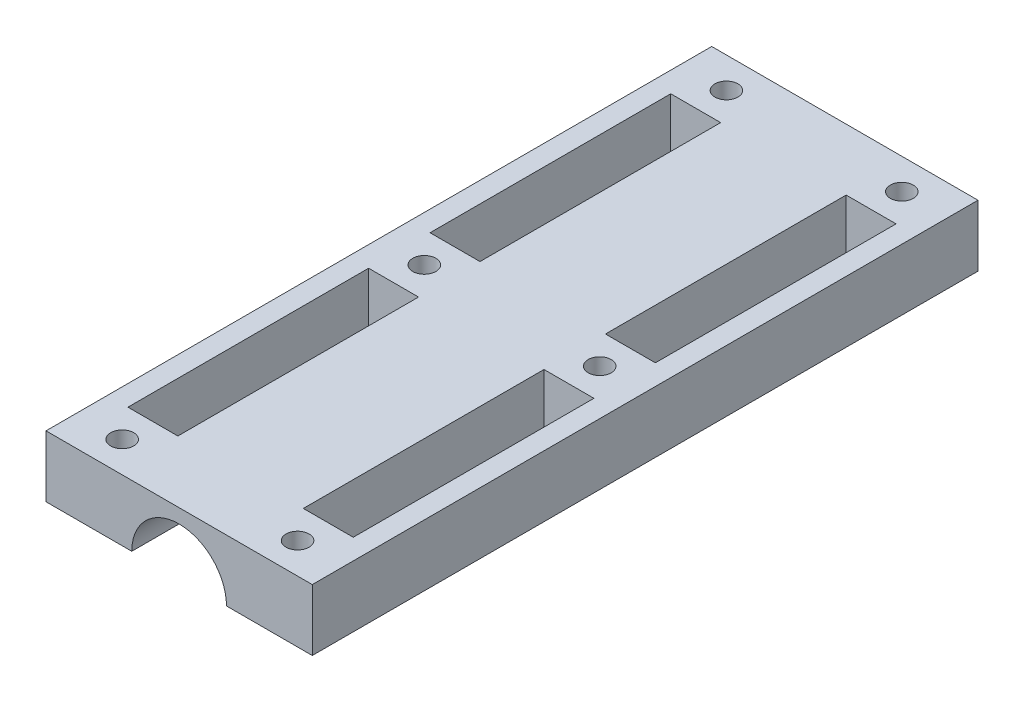
ISO-10303-21;
HEADER;
FILE_DESCRIPTION(('STEP AP214'),'2;1');
FILE_NAME('part.step','',(''),(''),'','','');
FILE_SCHEMA(('AUTOMOTIVE_DESIGN { 1 0 10303 214 1 1 1 1 }'));
ENDSEC;
DATA;
#1=APPLICATION_CONTEXT('core data for automotive mechanical design processes');
#2=APPLICATION_PROTOCOL_DEFINITION('international standard','automotive_design',2000,#1);
#3=PRODUCT_CONTEXT('',#1,'mechanical');
#4=PRODUCT('Part','Part','',(#3));
#5=PRODUCT_RELATED_PRODUCT_CATEGORY('part','',(#4));
#6=PRODUCT_DEFINITION_FORMATION('','',#4);
#7=PRODUCT_DEFINITION_CONTEXT('part definition',#1,'design');
#8=PRODUCT_DEFINITION('design','',#6,#7);
#9=PRODUCT_DEFINITION_SHAPE('','',#8);
#10=(LENGTH_UNIT() NAMED_UNIT(*) SI_UNIT(.MILLI.,.METRE.));
#11=(NAMED_UNIT(*) PLANE_ANGLE_UNIT() SI_UNIT($,.RADIAN.));
#12=(NAMED_UNIT(*) SI_UNIT($,.STERADIAN.) SOLID_ANGLE_UNIT());
#13=UNCERTAINTY_MEASURE_WITH_UNIT(LENGTH_MEASURE(1.E-05),#10,'distance_accuracy_value','');
#14=(GEOMETRIC_REPRESENTATION_CONTEXT(3) GLOBAL_UNCERTAINTY_ASSIGNED_CONTEXT((#13)) GLOBAL_UNIT_ASSIGNED_CONTEXT((#10,
#11,#12)) REPRESENTATION_CONTEXT('',''));
#15=CARTESIAN_POINT('',(0.,0.,0.));
#16=DIRECTION('',(0.,0.,1.));
#17=DIRECTION('',(1.,0.,0.));
#18=AXIS2_PLACEMENT_3D('',#15,#16,#17);
#19=CARTESIAN_POINT('',(9.25,-12.,-130.));
#20=DIRECTION('',(0.,1.,0.));
#21=DIRECTION('',(-1.,0.,0.));
#22=AXIS2_PLACEMENT_3D('',#19,#20,#21);
#23=PLANE('',#22);
#24=DIRECTION('',(-1.,0.,0.));
#25=VECTOR('',#24,1.);
#26=CARTESIAN_POINT('',(22.,-12.,-59.));
#27=LINE('',#26,#25);
#28=CARTESIAN_POINT('',(22.,-12.,-59.));
#29=VERTEX_POINT('',#28);
#30=CARTESIAN_POINT('',(12.25,-12.,-59.));
#31=VERTEX_POINT('',#30);
#32=EDGE_CURVE('E199',#29,#31,#27,.T.);
#33=ORIENTED_EDGE('',*,*,#32,.T.);
#34=DIRECTION('',(0.,0.,1.));
#35=VECTOR('',#34,1.);
#36=CARTESIAN_POINT('',(12.25,-12.,-12.));
#37=LINE('',#36,#35);
#38=CARTESIAN_POINT('',(12.25,-12.,-12.));
#39=VERTEX_POINT('',#38);
#40=EDGE_CURVE('E193',#31,#39,#37,.T.);
#41=ORIENTED_EDGE('',*,*,#40,.T.);
#42=DIRECTION('',(1.,0.,0.));
#43=VECTOR('',#42,1.);
#44=CARTESIAN_POINT('',(22.,-12.,-12.));
#45=LINE('',#44,#43);
#46=CARTESIAN_POINT('',(22.,-12.,-12.));
#47=VERTEX_POINT('',#46);
#48=EDGE_CURVE('E200',#39,#47,#45,.T.);
#49=ORIENTED_EDGE('',*,*,#48,.T.);
#50=DIRECTION('',(0.,0.,-1.));
#51=VECTOR('',#50,1.);
#52=CARTESIAN_POINT('',(22.,-12.,-12.));
#53=LINE('',#52,#51);
#54=EDGE_CURVE('E188',#47,#29,#53,.T.);
#55=ORIENTED_EDGE('',*,*,#54,.T.);
#56=EDGE_LOOP('',(#33,#41,#49,#55));
#57=FACE_BOUND('',#56,.T.);
#58=CARTESIAN_POINT('',(17.125,-12.,-6.));
#59=DIRECTION('',(0.,1.,0.));
#60=DIRECTION('',(0.,0.,-1.));
#61=AXIS2_PLACEMENT_3D('',#58,#59,#60);
#62=CIRCLE('',#61,2.25);
#63=CARTESIAN_POINT('',(17.125,-12.,-8.25));
#64=VERTEX_POINT('',#63);
#65=EDGE_CURVE('E215',#64,#64,#62,.T.);
#66=ORIENTED_EDGE('',*,*,#65,.T.);
#67=EDGE_LOOP('',(#66));
#68=FACE_BOUND('',#67,.T.);
#69=CARTESIAN_POINT('',(17.125,-12.,-124.));
#70=DIRECTION('',(0.,1.,0.));
#71=DIRECTION('',(0.,0.,-1.));
#72=AXIS2_PLACEMENT_3D('',#69,#70,#71);
#73=CIRCLE('',#72,2.25);
#74=CARTESIAN_POINT('',(17.125,-12.,-126.25));
#75=VERTEX_POINT('',#74);
#76=EDGE_CURVE('E228',#75,#75,#73,.T.);
#77=ORIENTED_EDGE('',*,*,#76,.T.);
#78=EDGE_LOOP('',(#77));
#79=FACE_BOUND('',#78,.T.);
#80=CARTESIAN_POINT('',(17.125,-12.,-65.));
#81=DIRECTION('',(0.,1.,0.));
#82=DIRECTION('',(0.,0.,-1.));
#83=AXIS2_PLACEMENT_3D('',#80,#81,#82);
#84=CIRCLE('',#83,2.25);
#85=CARTESIAN_POINT('',(17.125,-12.,-67.25));
#86=VERTEX_POINT('',#85);
#87=EDGE_CURVE('E234',#86,#86,#84,.T.);
#88=ORIENTED_EDGE('',*,*,#87,.T.);
#89=EDGE_LOOP('',(#88));
#90=FACE_BOUND('',#89,.T.);
#91=DIRECTION('',(1.,0.,0.));
#92=VECTOR('',#91,1.);
#93=CARTESIAN_POINT('',(9.25,-12.,0.));
#94=LINE('',#93,#92);
#95=CARTESIAN_POINT('',(9.25,-12.,0.));
#96=VERTEX_POINT('',#95);
#97=CARTESIAN_POINT('',(26.,-12.,0.));
#98=VERTEX_POINT('',#97);
#99=EDGE_CURVE('E379',#96,#98,#94,.T.);
#100=ORIENTED_EDGE('',*,*,#99,.F.);
#101=DIRECTION('',(0.,0.,1.));
#102=VECTOR('',#101,1.);
#103=CARTESIAN_POINT('',(9.25,-12.,-130.));
#104=LINE('',#103,#102);
#105=CARTESIAN_POINT('',(9.25,-12.,-130.));
#106=VERTEX_POINT('',#105);
#107=EDGE_CURVE('E394',#106,#96,#104,.T.);
#108=ORIENTED_EDGE('',*,*,#107,.F.);
#109=DIRECTION('',(1.,0.,0.));
#110=VECTOR('',#109,1.);
#111=CARTESIAN_POINT('',(9.25,-12.,-130.));
#112=LINE('',#111,#110);
#113=CARTESIAN_POINT('',(26.,-12.,-130.));
#114=VERTEX_POINT('',#113);
#115=EDGE_CURVE('E363',#106,#114,#112,.T.);
#116=ORIENTED_EDGE('',*,*,#115,.T.);
#117=DIRECTION('',(0.,0.,1.));
#118=VECTOR('',#117,1.);
#119=CARTESIAN_POINT('',(26.,-12.,-130.));
#120=LINE('',#119,#118);
#121=EDGE_CURVE('E391',#114,#98,#120,.T.);
#122=ORIENTED_EDGE('',*,*,#121,.T.);
#123=EDGE_LOOP('',(#100,#108,#116,#122));
#124=FACE_BOUND('',#123,.T.);
#125=DIRECTION('',(0.,0.,-1.));
#126=VECTOR('',#125,1.);
#127=CARTESIAN_POINT('',(22.,-12.,-71.));
#128=LINE('',#127,#126);
#129=CARTESIAN_POINT('',(22.,-12.,-71.));
#130=VERTEX_POINT('',#129);
#131=CARTESIAN_POINT('',(22.,-12.,-118.));
#132=VERTEX_POINT('',#131);
#133=EDGE_CURVE('E240',#130,#132,#128,.T.);
#134=ORIENTED_EDGE('',*,*,#133,.T.);
#135=DIRECTION('',(-1.,0.,0.));
#136=VECTOR('',#135,1.);
#137=CARTESIAN_POINT('',(22.,-12.,-118.));
#138=LINE('',#137,#136);
#139=CARTESIAN_POINT('',(12.25,-12.,-118.));
#140=VERTEX_POINT('',#139);
#141=EDGE_CURVE('E250',#132,#140,#138,.T.);
#142=ORIENTED_EDGE('',*,*,#141,.T.);
#143=DIRECTION('',(0.,0.,1.));
#144=VECTOR('',#143,1.);
#145=CARTESIAN_POINT('',(12.25,-12.,-71.));
#146=LINE('',#145,#144);
#147=CARTESIAN_POINT('',(12.25,-12.,-71.));
#148=VERTEX_POINT('',#147);
#149=EDGE_CURVE('E247',#140,#148,#146,.T.);
#150=ORIENTED_EDGE('',*,*,#149,.T.);
#151=DIRECTION('',(1.,0.,0.));
#152=VECTOR('',#151,1.);
#153=CARTESIAN_POINT('',(22.,-12.,-71.));
#154=LINE('',#153,#152);
#155=EDGE_CURVE('E243',#148,#130,#154,.T.);
#156=ORIENTED_EDGE('',*,*,#155,.T.);
#157=EDGE_LOOP('',(#134,#142,#150,#156));
#158=FACE_BOUND('',#157,.T.);
#159=ADVANCED_FACE('F37',(#57,#68,#79,#90,#124,#158),#23,.F.);
#160=CARTESIAN_POINT('',(-26.,0.,-130.));
#161=DIRECTION('',(0.,-1.,0.));
#162=DIRECTION('',(1.,0.,0.));
#163=AXIS2_PLACEMENT_3D('',#160,#161,#162);
#164=PLANE('',#163);
#165=DIRECTION('',(-1.,0.,0.));
#166=VECTOR('',#165,1.);
#167=CARTESIAN_POINT('',(22.,0.,-59.));
#168=LINE('',#167,#166);
#169=CARTESIAN_POINT('',(22.,0.,-59.));
#170=VERTEX_POINT('',#169);
#171=CARTESIAN_POINT('',(12.25,0.,-59.));
#172=VERTEX_POINT('',#171);
#173=EDGE_CURVE('E213',#170,#172,#168,.T.);
#174=ORIENTED_EDGE('',*,*,#173,.F.);
#175=DIRECTION('',(0.,0.,-1.));
#176=VECTOR('',#175,1.);
#177=CARTESIAN_POINT('',(22.,0.,-12.));
#178=LINE('',#177,#176);
#179=CARTESIAN_POINT('',(22.,0.,-12.));
#180=VERTEX_POINT('',#179);
#181=EDGE_CURVE('E191',#180,#170,#178,.T.);
#182=ORIENTED_EDGE('',*,*,#181,.F.);
#183=DIRECTION('',(1.,0.,0.));
#184=VECTOR('',#183,1.);
#185=CARTESIAN_POINT('',(22.,0.,-12.));
#186=LINE('',#185,#184);
#187=CARTESIAN_POINT('',(12.25,0.,-12.));
#188=VERTEX_POINT('',#187);
#189=EDGE_CURVE('E208',#188,#180,#186,.T.);
#190=ORIENTED_EDGE('',*,*,#189,.F.);
#191=DIRECTION('',(0.,0.,1.));
#192=VECTOR('',#191,1.);
#193=CARTESIAN_POINT('',(12.25,0.,-12.));
#194=LINE('',#193,#192);
#195=EDGE_CURVE('E205',#172,#188,#194,.T.);
#196=ORIENTED_EDGE('',*,*,#195,.F.);
#197=EDGE_LOOP('',(#174,#182,#190,#196));
#198=FACE_BOUND('',#197,.T.);
#199=CARTESIAN_POINT('',(17.125,0.,-6.));
#200=DIRECTION('',(0.,1.,0.));
#201=DIRECTION('',(0.,0.,-1.));
#202=AXIS2_PLACEMENT_3D('',#199,#200,#201);
#203=CIRCLE('',#202,2.25);
#204=CARTESIAN_POINT('',(17.125,0.,-8.25));
#205=VERTEX_POINT('',#204);
#206=EDGE_CURVE('E225',#205,#205,#203,.T.);
#207=ORIENTED_EDGE('',*,*,#206,.F.);
#208=EDGE_LOOP('',(#207));
#209=FACE_BOUND('',#208,.T.);
#210=CARTESIAN_POINT('',(17.125,0.,-124.));
#211=DIRECTION('',(0.,1.,0.));
#212=DIRECTION('',(0.,0.,-1.));
#213=AXIS2_PLACEMENT_3D('',#210,#211,#212);
#214=CIRCLE('',#213,2.25);
#215=CARTESIAN_POINT('',(17.125,0.,-126.25));
#216=VERTEX_POINT('',#215);
#217=EDGE_CURVE('E231',#216,#216,#214,.T.);
#218=ORIENTED_EDGE('',*,*,#217,.F.);
#219=EDGE_LOOP('',(#218));
#220=FACE_BOUND('',#219,.T.);
#221=CARTESIAN_POINT('',(17.125,0.,-65.));
#222=DIRECTION('',(0.,1.,0.));
#223=DIRECTION('',(0.,0.,-1.));
#224=AXIS2_PLACEMENT_3D('',#221,#222,#223);
#225=CIRCLE('',#224,2.25);
#226=CARTESIAN_POINT('',(17.125,0.,-67.25));
#227=VERTEX_POINT('',#226);
#228=EDGE_CURVE('E237',#227,#227,#225,.T.);
#229=ORIENTED_EDGE('',*,*,#228,.F.);
#230=EDGE_LOOP('',(#229));
#231=FACE_BOUND('',#230,.T.);
#232=DIRECTION('',(-1.,0.,0.));
#233=VECTOR('',#232,1.);
#234=CARTESIAN_POINT('',(-26.,0.,0.));
#235=LINE('',#234,#233);
#236=CARTESIAN_POINT('',(26.,0.,0.));
#237=VERTEX_POINT('',#236);
#238=CARTESIAN_POINT('',(-26.,0.,0.));
#239=VERTEX_POINT('',#238);
#240=EDGE_CURVE('E358',#237,#239,#235,.T.);
#241=ORIENTED_EDGE('',*,*,#240,.F.);
#242=DIRECTION('',(0.,0.,1.));
#243=VECTOR('',#242,1.);
#244=CARTESIAN_POINT('',(26.,0.,-130.));
#245=LINE('',#244,#243);
#246=CARTESIAN_POINT('',(26.,0.,-130.));
#247=VERTEX_POINT('',#246);
#248=EDGE_CURVE('E388',#247,#237,#245,.T.);
#249=ORIENTED_EDGE('',*,*,#248,.F.);
#250=DIRECTION('',(-1.,0.,0.));
#251=VECTOR('',#250,1.);
#252=CARTESIAN_POINT('',(-26.,0.,-130.));
#253=LINE('',#252,#251);
#254=CARTESIAN_POINT('',(-26.,0.,-130.));
#255=VERTEX_POINT('',#254);
#256=EDGE_CURVE('E368',#247,#255,#253,.T.);
#257=ORIENTED_EDGE('',*,*,#256,.T.);
#258=DIRECTION('',(0.,0.,1.));
#259=VECTOR('',#258,1.);
#260=CARTESIAN_POINT('',(-26.,0.,-130.));
#261=LINE('',#260,#259);
#262=EDGE_CURVE('E371',#255,#239,#261,.T.);
#263=ORIENTED_EDGE('',*,*,#262,.T.);
#264=EDGE_LOOP('',(#241,#249,#257,#263));
#265=FACE_BOUND('',#264,.T.);
#266=DIRECTION('',(1.,0.,0.));
#267=VECTOR('',#266,1.);
#268=CARTESIAN_POINT('',(-22.,0.,-118.));
#269=LINE('',#268,#267);
#270=CARTESIAN_POINT('',(-22.,0.,-118.));
#271=VERTEX_POINT('',#270);
#272=CARTESIAN_POINT('',(-12.25,0.,-118.));
#273=VERTEX_POINT('',#272);
#274=EDGE_CURVE('E338',#271,#273,#269,.T.);
#275=ORIENTED_EDGE('',*,*,#274,.T.);
#276=DIRECTION('',(0.,0.,1.));
#277=VECTOR('',#276,1.);
#278=CARTESIAN_POINT('',(-12.25,0.,-71.));
#279=LINE('',#278,#277);
#280=CARTESIAN_POINT('',(-12.25,0.,-71.));
#281=VERTEX_POINT('',#280);
#282=EDGE_CURVE('E341',#273,#281,#279,.T.);
#283=ORIENTED_EDGE('',*,*,#282,.T.);
#284=DIRECTION('',(-1.,0.,0.));
#285=VECTOR('',#284,1.);
#286=CARTESIAN_POINT('',(-22.,0.,-71.));
#287=LINE('',#286,#285);
#288=CARTESIAN_POINT('',(-22.,0.,-71.));
#289=VERTEX_POINT('',#288);
#290=EDGE_CURVE('E326',#281,#289,#287,.T.);
#291=ORIENTED_EDGE('',*,*,#290,.T.);
#292=DIRECTION('',(0.,0.,-1.));
#293=VECTOR('',#292,1.);
#294=CARTESIAN_POINT('',(-22.,0.,-71.));
#295=LINE('',#294,#293);
#296=EDGE_CURVE('E300',#289,#271,#295,.T.);
#297=ORIENTED_EDGE('',*,*,#296,.T.);
#298=EDGE_LOOP('',(#275,#283,#291,#297));
#299=FACE_BOUND('',#298,.T.);
#300=CARTESIAN_POINT('',(-17.125,0.,-65.));
#301=DIRECTION('',(0.,-1.,0.));
#302=DIRECTION('',(0.,0.,-1.));
#303=AXIS2_PLACEMENT_3D('',#300,#301,#302);
#304=CIRCLE('',#303,2.25);
#305=CARTESIAN_POINT('',(-17.125,0.,-67.25));
#306=VERTEX_POINT('',#305);
#307=EDGE_CURVE('E266',#306,#306,#304,.T.);
#308=ORIENTED_EDGE('',*,*,#307,.T.);
#309=EDGE_LOOP('',(#308));
#310=FACE_BOUND('',#309,.T.);
#311=CARTESIAN_POINT('',(-17.125,0.,-124.));
#312=DIRECTION('',(0.,-1.,0.));
#313=DIRECTION('',(0.,0.,-1.));
#314=AXIS2_PLACEMENT_3D('',#311,#312,#313);
#315=CIRCLE('',#314,2.25);
#316=CARTESIAN_POINT('',(-17.125,0.,-126.25));
#317=VERTEX_POINT('',#316);
#318=EDGE_CURVE('E314',#317,#317,#315,.T.);
#319=ORIENTED_EDGE('',*,*,#318,.T.);
#320=EDGE_LOOP('',(#319));
#321=FACE_BOUND('',#320,.T.);
#322=CARTESIAN_POINT('',(-17.125,0.,-6.));
#323=DIRECTION('',(0.,-1.,0.));
#324=DIRECTION('',(0.,0.,-1.));
#325=AXIS2_PLACEMENT_3D('',#322,#323,#324);
#326=CIRCLE('',#325,2.25);
#327=CARTESIAN_POINT('',(-17.125,0.,-8.25));
#328=VERTEX_POINT('',#327);
#329=EDGE_CURVE('E308',#328,#328,#326,.T.);
#330=ORIENTED_EDGE('',*,*,#329,.T.);
#331=EDGE_LOOP('',(#330));
#332=FACE_BOUND('',#331,.T.);
#333=DIRECTION('',(0.,0.,1.));
#334=VECTOR('',#333,1.);
#335=CARTESIAN_POINT('',(-12.25,0.,-12.));
#336=LINE('',#335,#334);
#337=CARTESIAN_POINT('',(-12.25,0.,-59.));
#338=VERTEX_POINT('',#337);
#339=CARTESIAN_POINT('',(-12.25,0.,-12.));
#340=VERTEX_POINT('',#339);
#341=EDGE_CURVE('E289',#338,#340,#336,.T.);
#342=ORIENTED_EDGE('',*,*,#341,.T.);
#343=DIRECTION('',(-1.,0.,0.));
#344=VECTOR('',#343,1.);
#345=CARTESIAN_POINT('',(-22.,0.,-12.));
#346=LINE('',#345,#344);
#347=CARTESIAN_POINT('',(-22.,0.,-12.));
#348=VERTEX_POINT('',#347);
#349=EDGE_CURVE('E293',#340,#348,#346,.T.);
#350=ORIENTED_EDGE('',*,*,#349,.T.);
#351=DIRECTION('',(0.,0.,-1.));
#352=VECTOR('',#351,1.);
#353=CARTESIAN_POINT('',(-22.,0.,-12.));
#354=LINE('',#353,#352);
#355=CARTESIAN_POINT('',(-22.,0.,-59.));
#356=VERTEX_POINT('',#355);
#357=EDGE_CURVE('E276',#348,#356,#354,.T.);
#358=ORIENTED_EDGE('',*,*,#357,.T.);
#359=DIRECTION('',(1.,0.,0.));
#360=VECTOR('',#359,1.);
#361=CARTESIAN_POINT('',(-22.,0.,-59.));
#362=LINE('',#361,#360);
#363=EDGE_CURVE('E286',#356,#338,#362,.T.);
#364=ORIENTED_EDGE('',*,*,#363,.T.);
#365=EDGE_LOOP('',(#342,#350,#358,#364));
#366=FACE_BOUND('',#365,.T.);
#367=DIRECTION('',(0.,0.,-1.));
#368=VECTOR('',#367,1.);
#369=CARTESIAN_POINT('',(22.,0.,-71.));
#370=LINE('',#369,#368);
#371=CARTESIAN_POINT('',(22.,0.,-71.));
#372=VERTEX_POINT('',#371);
#373=CARTESIAN_POINT('',(22.,0.,-118.));
#374=VERTEX_POINT('',#373);
#375=EDGE_CURVE('E219',#372,#374,#370,.T.);
#376=ORIENTED_EDGE('',*,*,#375,.F.);
#377=DIRECTION('',(1.,0.,0.));
#378=VECTOR('',#377,1.);
#379=CARTESIAN_POINT('',(22.,0.,-71.));
#380=LINE('',#379,#378);
#381=CARTESIAN_POINT('',(12.25,0.,-71.));
#382=VERTEX_POINT('',#381);
#383=EDGE_CURVE('E256',#382,#372,#380,.T.);
#384=ORIENTED_EDGE('',*,*,#383,.F.);
#385=DIRECTION('',(0.,0.,1.));
#386=VECTOR('',#385,1.);
#387=CARTESIAN_POINT('',(12.25,0.,-71.));
#388=LINE('',#387,#386);
#389=CARTESIAN_POINT('',(12.25,0.,-118.));
#390=VERTEX_POINT('',#389);
#391=EDGE_CURVE('E259',#390,#382,#388,.T.);
#392=ORIENTED_EDGE('',*,*,#391,.F.);
#393=DIRECTION('',(-1.,0.,0.));
#394=VECTOR('',#393,1.);
#395=CARTESIAN_POINT('',(22.,0.,-118.));
#396=LINE('',#395,#394);
#397=EDGE_CURVE('E244',#374,#390,#396,.T.);
#398=ORIENTED_EDGE('',*,*,#397,.F.);
#399=EDGE_LOOP('',(#376,#384,#392,#398));
#400=FACE_BOUND('',#399,.T.);
#401=ADVANCED_FACE('F408',(#198,#209,#220,#231,#265,#299,#310,#321,#332,#366,#400),#164,.F.);
#402=CARTESIAN_POINT('',(-26.,0.,-130.));
#403=DIRECTION('',(1.,0.,0.));
#404=DIRECTION('',(0.,0.,1.));
#405=AXIS2_PLACEMENT_3D('',#402,#403,#404);
#406=PLANE('',#405);
#407=DIRECTION('',(0.,-1.,0.));
#408=VECTOR('',#407,1.);
#409=CARTESIAN_POINT('',(-26.,0.,0.));
#410=LINE('',#409,#408);
#411=CARTESIAN_POINT('',(-26.,-12.,0.));
#412=VERTEX_POINT('',#411);
#413=EDGE_CURVE('E348',#239,#412,#410,.T.);
#414=ORIENTED_EDGE('',*,*,#413,.F.);
#415=ORIENTED_EDGE('',*,*,#262,.F.);
#416=DIRECTION('',(0.,-1.,0.));
#417=VECTOR('',#416,1.);
#418=CARTESIAN_POINT('',(-26.,0.,-130.));
#419=LINE('',#418,#417);
#420=CARTESIAN_POINT('',(-26.,-12.,-130.));
#421=VERTEX_POINT('',#420);
#422=EDGE_CURVE('E354',#255,#421,#419,.T.);
#423=ORIENTED_EDGE('',*,*,#422,.T.);
#424=DIRECTION('',(0.,0.,1.));
#425=VECTOR('',#424,1.);
#426=CARTESIAN_POINT('',(-26.,-12.,-130.));
#427=LINE('',#426,#425);
#428=EDGE_CURVE('E11',#421,#412,#427,.T.);
#429=ORIENTED_EDGE('',*,*,#428,.T.);
#430=EDGE_LOOP('',(#414,#415,#423,#429));
#431=FACE_BOUND('',#430,.T.);
#432=ADVANCED_FACE('F39',(#431),#406,.F.);
#433=CARTESIAN_POINT('',(-26.,-12.,-130.));
#434=DIRECTION('',(0.,1.,0.));
#435=DIRECTION('',(0.,0.,-1.));
#436=AXIS2_PLACEMENT_3D('',#433,#434,#435);
#437=PLANE('',#436);
#438=DIRECTION('',(0.,0.,-1.));
#439=VECTOR('',#438,1.);
#440=CARTESIAN_POINT('',(-22.,-12.,-12.));
#441=LINE('',#440,#439);
#442=CARTESIAN_POINT('',(-22.,-12.,-12.));
#443=VERTEX_POINT('',#442);
#444=CARTESIAN_POINT('',(-22.,-12.,-59.));
#445=VERTEX_POINT('',#444);
#446=EDGE_CURVE('E282',#443,#445,#441,.T.);
#447=ORIENTED_EDGE('',*,*,#446,.F.);
#448=DIRECTION('',(-1.,0.,0.));
#449=VECTOR('',#448,1.);
#450=CARTESIAN_POINT('',(-22.,-12.,-12.));
#451=LINE('',#450,#449);
#452=CARTESIAN_POINT('',(-12.25,-12.,-12.));
#453=VERTEX_POINT('',#452);
#454=EDGE_CURVE('E279',#453,#443,#451,.T.);
#455=ORIENTED_EDGE('',*,*,#454,.F.);
#456=DIRECTION('',(0.,0.,1.));
#457=VECTOR('',#456,1.);
#458=CARTESIAN_POINT('',(-12.25,-12.,-12.));
#459=LINE('',#458,#457);
#460=CARTESIAN_POINT('',(-12.25,-12.,-59.));
#461=VERTEX_POINT('',#460);
#462=EDGE_CURVE('E275',#461,#453,#459,.T.);
#463=ORIENTED_EDGE('',*,*,#462,.F.);
#464=DIRECTION('',(1.,0.,0.));
#465=VECTOR('',#464,1.);
#466=CARTESIAN_POINT('',(-22.,-12.,-59.));
#467=LINE('',#466,#465);
#468=EDGE_CURVE('E272',#445,#461,#467,.T.);
#469=ORIENTED_EDGE('',*,*,#468,.F.);
#470=EDGE_LOOP('',(#447,#455,#463,#469));
#471=FACE_BOUND('',#470,.T.);
#472=CARTESIAN_POINT('',(-17.125,-12.,-6.));
#473=DIRECTION('',(0.,-1.,0.));
#474=DIRECTION('',(0.,0.,-1.));
#475=AXIS2_PLACEMENT_3D('',#472,#473,#474);
#476=CIRCLE('',#475,2.25);
#477=CARTESIAN_POINT('',(-17.125,-12.,-8.25));
#478=VERTEX_POINT('',#477);
#479=EDGE_CURVE('E290',#478,#478,#476,.T.);
#480=ORIENTED_EDGE('',*,*,#479,.F.);
#481=EDGE_LOOP('',(#480));
#482=FACE_BOUND('',#481,.T.);
#483=CARTESIAN_POINT('',(-17.125,-12.,-124.));
#484=DIRECTION('',(0.,-1.,0.));
#485=DIRECTION('',(0.,0.,-1.));
#486=AXIS2_PLACEMENT_3D('',#483,#484,#485);
#487=CIRCLE('',#486,2.25);
#488=CARTESIAN_POINT('',(-17.125,-12.,-126.25));
#489=VERTEX_POINT('',#488);
#490=EDGE_CURVE('E311',#489,#489,#487,.T.);
#491=ORIENTED_EDGE('',*,*,#490,.F.);
#492=EDGE_LOOP('',(#491));
#493=FACE_BOUND('',#492,.T.);
#494=CARTESIAN_POINT('',(-17.125,-12.,-65.));
#495=DIRECTION('',(0.,-1.,0.));
#496=DIRECTION('',(0.,0.,-1.));
#497=AXIS2_PLACEMENT_3D('',#494,#495,#496);
#498=CIRCLE('',#497,2.25);
#499=CARTESIAN_POINT('',(-17.125,-12.,-67.25));
#500=VERTEX_POINT('',#499);
#501=EDGE_CURVE('E317',#500,#500,#498,.T.);
#502=ORIENTED_EDGE('',*,*,#501,.F.);
#503=EDGE_LOOP('',(#502));
#504=FACE_BOUND('',#503,.T.);
#505=DIRECTION('',(-1.,0.,0.));
#506=VECTOR('',#505,1.);
#507=CARTESIAN_POINT('',(-22.,-12.,-71.));
#508=LINE('',#507,#506);
#509=CARTESIAN_POINT('',(-12.25,-12.,-71.));
#510=VERTEX_POINT('',#509);
#511=CARTESIAN_POINT('',(-22.,-12.,-71.));
#512=VERTEX_POINT('',#511);
#513=EDGE_CURVE('E332',#510,#512,#508,.T.);
#514=ORIENTED_EDGE('',*,*,#513,.F.);
#515=DIRECTION('',(0.,0.,1.));
#516=VECTOR('',#515,1.);
#517=CARTESIAN_POINT('',(-12.25,-12.,-71.));
#518=LINE('',#517,#516);
#519=CARTESIAN_POINT('',(-12.25,-12.,-118.));
#520=VERTEX_POINT('',#519);
#521=EDGE_CURVE('E329',#520,#510,#518,.T.);
#522=ORIENTED_EDGE('',*,*,#521,.F.);
#523=DIRECTION('',(1.,0.,0.));
#524=VECTOR('',#523,1.);
#525=CARTESIAN_POINT('',(-22.,-12.,-118.));
#526=LINE('',#525,#524);
#527=CARTESIAN_POINT('',(-22.,-12.,-118.));
#528=VERTEX_POINT('',#527);
#529=EDGE_CURVE('E325',#528,#520,#526,.T.);
#530=ORIENTED_EDGE('',*,*,#529,.F.);
#531=DIRECTION('',(0.,0.,-1.));
#532=VECTOR('',#531,1.);
#533=CARTESIAN_POINT('',(-22.,-12.,-71.));
#534=LINE('',#533,#532);
#535=EDGE_CURVE('E322',#512,#528,#534,.T.);
#536=ORIENTED_EDGE('',*,*,#535,.F.);
#537=EDGE_LOOP('',(#514,#522,#530,#536));
#538=FACE_BOUND('',#537,.T.);
#539=DIRECTION('',(1.,0.,0.));
#540=VECTOR('',#539,1.);
#541=CARTESIAN_POINT('',(-26.,-12.,0.));
#542=LINE('',#541,#540);
#543=CARTESIAN_POINT('',(-9.25,-12.,0.));
#544=VERTEX_POINT('',#543);
#545=EDGE_CURVE('E374',#412,#544,#542,.T.);
#546=ORIENTED_EDGE('',*,*,#545,.F.);
#547=ORIENTED_EDGE('',*,*,#428,.F.);
#548=DIRECTION('',(1.,0.,0.));
#549=VECTOR('',#548,1.);
#550=CARTESIAN_POINT('',(-26.,-12.,-130.));
#551=LINE('',#550,#549);
#552=CARTESIAN_POINT('',(-9.25,-12.,-130.));
#553=VERTEX_POINT('',#552);
#554=EDGE_CURVE('E357',#421,#553,#551,.T.);
#555=ORIENTED_EDGE('',*,*,#554,.T.);
#556=DIRECTION('',(0.,0.,1.));
#557=VECTOR('',#556,1.);
#558=CARTESIAN_POINT('',(-9.25,-12.,-130.));
#559=LINE('',#558,#557);
#560=EDGE_CURVE('E45',#553,#544,#559,.T.);
#561=ORIENTED_EDGE('',*,*,#560,.T.);
#562=EDGE_LOOP('',(#546,#547,#555,#561));
#563=FACE_BOUND('',#562,.T.);
#564=ADVANCED_FACE('F399',(#471,#482,#493,#504,#538,#563),#437,.F.);
#565=CARTESIAN_POINT('',(0.,-12.,-130.));
#566=DIRECTION('',(0.,0.,1.));
#567=DIRECTION('',(-1.,0.,0.));
#568=AXIS2_PLACEMENT_3D('',#565,#566,#567);
#569=CYLINDRICAL_SURFACE('',#568,9.25);
#570=CARTESIAN_POINT('',(0.,-12.,0.));
#571=DIRECTION('',(0.,0.,-1.));
#572=DIRECTION('',(1.,0.,0.));
#573=AXIS2_PLACEMENT_3D('',#570,#571,#572);
#574=CIRCLE('',#573,9.25);
#575=EDGE_CURVE('E377',#544,#96,#574,.T.);
#576=ORIENTED_EDGE('',*,*,#575,.F.);
#577=ORIENTED_EDGE('',*,*,#560,.F.);
#578=CARTESIAN_POINT('',(0.,-12.,-130.));
#579=DIRECTION('',(0.,0.,-1.));
#580=DIRECTION('',(1.,0.,0.));
#581=AXIS2_PLACEMENT_3D('',#578,#579,#580);
#582=CIRCLE('',#581,9.25);
#583=EDGE_CURVE('E361',#553,#106,#582,.T.);
#584=ORIENTED_EDGE('',*,*,#583,.T.);
#585=ORIENTED_EDGE('',*,*,#107,.T.);
#586=EDGE_LOOP('',(#576,#577,#584,#585));
#587=FACE_BOUND('',#586,.T.);
#588=ADVANCED_FACE('F417',(#587),#569,.F.);
#589=CARTESIAN_POINT('',(26.,0.,-130.));
#590=DIRECTION('',(-1.,0.,0.));
#591=DIRECTION('',(0.,-1.,0.));
#592=AXIS2_PLACEMENT_3D('',#589,#590,#591);
#593=PLANE('',#592);
#594=DIRECTION('',(0.,1.,0.));
#595=VECTOR('',#594,1.);
#596=CARTESIAN_POINT('',(26.,0.,0.));
#597=LINE('',#596,#595);
#598=EDGE_CURVE('E382',#98,#237,#597,.T.);
#599=ORIENTED_EDGE('',*,*,#598,.F.);
#600=ORIENTED_EDGE('',*,*,#121,.F.);
#601=DIRECTION('',(0.,1.,0.));
#602=VECTOR('',#601,1.);
#603=CARTESIAN_POINT('',(26.,0.,-130.));
#604=LINE('',#603,#602);
#605=EDGE_CURVE('E366',#114,#247,#604,.T.);
#606=ORIENTED_EDGE('',*,*,#605,.T.);
#607=ORIENTED_EDGE('',*,*,#248,.T.);
#608=EDGE_LOOP('',(#599,#600,#606,#607));
#609=FACE_BOUND('',#608,.T.);
#610=ADVANCED_FACE('F422',(#609),#593,.F.);
#611=CARTESIAN_POINT('',(0.,-12.,-130.));
#612=DIRECTION('',(0.,0.,-1.));
#613=DIRECTION('',(1.,0.,0.));
#614=AXIS2_PLACEMENT_3D('',#611,#612,#613);
#615=PLANE('',#614);
#616=ORIENTED_EDGE('',*,*,#422,.F.);
#617=ORIENTED_EDGE('',*,*,#256,.F.);
#618=ORIENTED_EDGE('',*,*,#605,.F.);
#619=ORIENTED_EDGE('',*,*,#115,.F.);
#620=ORIENTED_EDGE('',*,*,#583,.F.);
#621=ORIENTED_EDGE('',*,*,#554,.F.);
#622=EDGE_LOOP('',(#616,#617,#618,#619,#620,#621));
#623=FACE_BOUND('',#622,.T.);
#624=ADVANCED_FACE('F413',(#623),#615,.T.);
#625=CARTESIAN_POINT('',(0.,-12.,0.));
#626=DIRECTION('',(0.,0.,-1.));
#627=DIRECTION('',(1.,0.,0.));
#628=AXIS2_PLACEMENT_3D('',#625,#626,#627);
#629=PLANE('',#628);
#630=ORIENTED_EDGE('',*,*,#413,.T.);
#631=ORIENTED_EDGE('',*,*,#545,.T.);
#632=ORIENTED_EDGE('',*,*,#575,.T.);
#633=ORIENTED_EDGE('',*,*,#99,.T.);
#634=ORIENTED_EDGE('',*,*,#598,.T.);
#635=ORIENTED_EDGE('',*,*,#240,.T.);
#636=EDGE_LOOP('',(#630,#631,#632,#633,#634,#635));
#637=FACE_BOUND('',#636,.T.);
#638=ADVANCED_FACE('F403',(#637),#629,.F.);
#639=CARTESIAN_POINT('',(-22.,-12.,-71.));
#640=DIRECTION('',(-1.,0.,0.));
#641=DIRECTION('',(0.,0.,-1.));
#642=AXIS2_PLACEMENT_3D('',#639,#640,#641);
#643=PLANE('',#642);
#644=ORIENTED_EDGE('',*,*,#296,.F.);
#645=DIRECTION('',(0.,1.,0.));
#646=VECTOR('',#645,1.);
#647=CARTESIAN_POINT('',(-22.,-12.,-71.));
#648=LINE('',#647,#646);
#649=EDGE_CURVE('E346',#512,#289,#648,.T.);
#650=ORIENTED_EDGE('',*,*,#649,.F.);
#651=ORIENTED_EDGE('',*,*,#535,.T.);
#652=DIRECTION('',(0.,1.,0.));
#653=VECTOR('',#652,1.);
#654=CARTESIAN_POINT('',(-22.,-12.,-118.));
#655=LINE('',#654,#653);
#656=EDGE_CURVE('E335',#528,#271,#655,.T.);
#657=ORIENTED_EDGE('',*,*,#656,.T.);
#658=EDGE_LOOP('',(#644,#650,#651,#657));
#659=FACE_BOUND('',#658,.T.);
#660=ADVANCED_FACE('F468',(#659),#643,.F.);
#661=CARTESIAN_POINT('',(-22.,-12.,-71.));
#662=DIRECTION('',(0.,0.,1.));
#663=DIRECTION('',(-1.,0.,0.));
#664=AXIS2_PLACEMENT_3D('',#661,#662,#663);
#665=PLANE('',#664);
#666=ORIENTED_EDGE('',*,*,#290,.F.);
#667=DIRECTION('',(0.,1.,0.));
#668=VECTOR('',#667,1.);
#669=CARTESIAN_POINT('',(-12.25,-12.,-71.));
#670=LINE('',#669,#668);
#671=EDGE_CURVE('E349',#510,#281,#670,.T.);
#672=ORIENTED_EDGE('',*,*,#671,.F.);
#673=ORIENTED_EDGE('',*,*,#513,.T.);
#674=ORIENTED_EDGE('',*,*,#649,.T.);
#675=EDGE_LOOP('',(#666,#672,#673,#674));
#676=FACE_BOUND('',#675,.T.);
#677=ADVANCED_FACE('F459',(#676),#665,.F.);
#678=CARTESIAN_POINT('',(-12.25,-12.,-71.));
#679=DIRECTION('',(1.,0.,0.));
#680=DIRECTION('',(0.,0.,1.));
#681=AXIS2_PLACEMENT_3D('',#678,#679,#680);
#682=PLANE('',#681);
#683=ORIENTED_EDGE('',*,*,#282,.F.);
#684=DIRECTION('',(0.,1.,0.));
#685=VECTOR('',#684,1.);
#686=CARTESIAN_POINT('',(-12.25,-12.,-118.));
#687=LINE('',#686,#685);
#688=EDGE_CURVE('E351',#520,#273,#687,.T.);
#689=ORIENTED_EDGE('',*,*,#688,.F.);
#690=ORIENTED_EDGE('',*,*,#521,.T.);
#691=ORIENTED_EDGE('',*,*,#671,.T.);
#692=EDGE_LOOP('',(#683,#689,#690,#691));
#693=FACE_BOUND('',#692,.T.);
#694=ADVANCED_FACE('F463',(#693),#682,.F.);
#695=CARTESIAN_POINT('',(-22.,-12.,-118.));
#696=DIRECTION('',(0.,0.,-1.));
#697=DIRECTION('',(1.,0.,0.));
#698=AXIS2_PLACEMENT_3D('',#695,#696,#697);
#699=PLANE('',#698);
#700=ORIENTED_EDGE('',*,*,#274,.F.);
#701=ORIENTED_EDGE('',*,*,#656,.F.);
#702=ORIENTED_EDGE('',*,*,#529,.T.);
#703=ORIENTED_EDGE('',*,*,#688,.T.);
#704=EDGE_LOOP('',(#700,#701,#702,#703));
#705=FACE_BOUND('',#704,.T.);
#706=ADVANCED_FACE('F466',(#705),#699,.F.);
#707=CARTESIAN_POINT('',(-17.125,-12.,-65.));
#708=DIRECTION('',(0.,1.,0.));
#709=DIRECTION('',(0.,0.,-1.));
#710=AXIS2_PLACEMENT_3D('',#707,#708,#709);
#711=CYLINDRICAL_SURFACE('',#710,2.25);
#712=ORIENTED_EDGE('',*,*,#501,.T.);
#713=EDGE_LOOP('',(#712));
#714=FACE_BOUND('',#713,.T.);
#715=ORIENTED_EDGE('',*,*,#307,.F.);
#716=EDGE_LOOP('',(#715));
#717=FACE_BOUND('',#716,.T.);
#718=ADVANCED_FACE('F531',(#714,#717),#711,.F.);
#719=CARTESIAN_POINT('',(-17.125,-12.,-124.));
#720=DIRECTION('',(0.,1.,0.));
#721=DIRECTION('',(0.,0.,-1.));
#722=AXIS2_PLACEMENT_3D('',#719,#720,#721);
#723=CYLINDRICAL_SURFACE('',#722,2.25);
#724=ORIENTED_EDGE('',*,*,#490,.T.);
#725=EDGE_LOOP('',(#724));
#726=FACE_BOUND('',#725,.T.);
#727=ORIENTED_EDGE('',*,*,#318,.F.);
#728=EDGE_LOOP('',(#727));
#729=FACE_BOUND('',#728,.T.);
#730=ADVANCED_FACE('F527',(#726,#729),#723,.F.);
#731=CARTESIAN_POINT('',(-17.125,-12.,-6.));
#732=DIRECTION('',(0.,1.,0.));
#733=DIRECTION('',(0.,0.,-1.));
#734=AXIS2_PLACEMENT_3D('',#731,#732,#733);
#735=CYLINDRICAL_SURFACE('',#734,2.25);
#736=ORIENTED_EDGE('',*,*,#479,.T.);
#737=EDGE_LOOP('',(#736));
#738=FACE_BOUND('',#737,.T.);
#739=ORIENTED_EDGE('',*,*,#329,.F.);
#740=EDGE_LOOP('',(#739));
#741=FACE_BOUND('',#740,.T.);
#742=ADVANCED_FACE('F523',(#738,#741),#735,.F.);
#743=CARTESIAN_POINT('',(-22.,-12.,-59.));
#744=DIRECTION('',(0.,0.,-1.));
#745=DIRECTION('',(1.,0.,0.));
#746=AXIS2_PLACEMENT_3D('',#743,#744,#745);
#747=PLANE('',#746);
#748=ORIENTED_EDGE('',*,*,#363,.F.);
#749=DIRECTION('',(0.,1.,0.));
#750=VECTOR('',#749,1.);
#751=CARTESIAN_POINT('',(-22.,-12.,-59.));
#752=LINE('',#751,#750);
#753=EDGE_CURVE('E298',#445,#356,#752,.T.);
#754=ORIENTED_EDGE('',*,*,#753,.F.);
#755=ORIENTED_EDGE('',*,*,#468,.T.);
#756=DIRECTION('',(0.,1.,0.));
#757=VECTOR('',#756,1.);
#758=CARTESIAN_POINT('',(-12.25,-12.,-59.));
#759=LINE('',#758,#757);
#760=EDGE_CURVE('E285',#461,#338,#759,.T.);
#761=ORIENTED_EDGE('',*,*,#760,.T.);
#762=EDGE_LOOP('',(#748,#754,#755,#761));
#763=FACE_BOUND('',#762,.T.);
#764=ADVANCED_FACE('F513',(#763),#747,.F.);
#765=CARTESIAN_POINT('',(-22.,-12.,-12.));
#766=DIRECTION('',(-1.,0.,0.));
#767=DIRECTION('',(0.,0.,-1.));
#768=AXIS2_PLACEMENT_3D('',#765,#766,#767);
#769=PLANE('',#768);
#770=ORIENTED_EDGE('',*,*,#357,.F.);
#771=DIRECTION('',(0.,1.,0.));
#772=VECTOR('',#771,1.);
#773=CARTESIAN_POINT('',(-22.,-12.,-12.));
#774=LINE('',#773,#772);
#775=EDGE_CURVE('E301',#443,#348,#774,.T.);
#776=ORIENTED_EDGE('',*,*,#775,.F.);
#777=ORIENTED_EDGE('',*,*,#446,.T.);
#778=ORIENTED_EDGE('',*,*,#753,.T.);
#779=EDGE_LOOP('',(#770,#776,#777,#778));
#780=FACE_BOUND('',#779,.T.);
#781=ADVANCED_FACE('F509',(#780),#769,.F.);
#782=CARTESIAN_POINT('',(-22.,-12.,-12.));
#783=DIRECTION('',(0.,0.,1.));
#784=DIRECTION('',(-1.,0.,0.));
#785=AXIS2_PLACEMENT_3D('',#782,#783,#784);
#786=PLANE('',#785);
#787=ORIENTED_EDGE('',*,*,#349,.F.);
#788=DIRECTION('',(0.,1.,0.));
#789=VECTOR('',#788,1.);
#790=CARTESIAN_POINT('',(-12.25,-12.,-12.));
#791=LINE('',#790,#789);
#792=EDGE_CURVE('E303',#453,#340,#791,.T.);
#793=ORIENTED_EDGE('',*,*,#792,.F.);
#794=ORIENTED_EDGE('',*,*,#454,.T.);
#795=ORIENTED_EDGE('',*,*,#775,.T.);
#796=EDGE_LOOP('',(#787,#793,#794,#795));
#797=FACE_BOUND('',#796,.T.);
#798=ADVANCED_FACE('F512',(#797),#786,.F.);
#799=CARTESIAN_POINT('',(-12.25,-12.,-12.));
#800=DIRECTION('',(1.,0.,0.));
#801=DIRECTION('',(0.,0.,1.));
#802=AXIS2_PLACEMENT_3D('',#799,#800,#801);
#803=PLANE('',#802);
#804=ORIENTED_EDGE('',*,*,#341,.F.);
#805=ORIENTED_EDGE('',*,*,#760,.F.);
#806=ORIENTED_EDGE('',*,*,#462,.T.);
#807=ORIENTED_EDGE('',*,*,#792,.T.);
#808=EDGE_LOOP('',(#804,#805,#806,#807));
#809=FACE_BOUND('',#808,.T.);
#810=ADVANCED_FACE('F501',(#809),#803,.F.);
#811=CARTESIAN_POINT('',(22.,-12.,-71.));
#812=DIRECTION('',(-1.,0.,0.));
#813=DIRECTION('',(0.,0.,-1.));
#814=AXIS2_PLACEMENT_3D('',#811,#812,#813);
#815=PLANE('',#814);
#816=ORIENTED_EDGE('',*,*,#375,.T.);
#817=DIRECTION('',(0.,1.,0.));
#818=VECTOR('',#817,1.);
#819=CARTESIAN_POINT('',(22.,-12.,-118.));
#820=LINE('',#819,#818);
#821=EDGE_CURVE('E264',#132,#374,#820,.T.);
#822=ORIENTED_EDGE('',*,*,#821,.F.);
#823=ORIENTED_EDGE('',*,*,#133,.F.);
#824=DIRECTION('',(0.,1.,0.));
#825=VECTOR('',#824,1.);
#826=CARTESIAN_POINT('',(22.,-12.,-71.));
#827=LINE('',#826,#825);
#828=EDGE_CURVE('E253',#130,#372,#827,.T.);
#829=ORIENTED_EDGE('',*,*,#828,.T.);
#830=EDGE_LOOP('',(#816,#822,#823,#829));
#831=FACE_BOUND('',#830,.T.);
#832=ADVANCED_FACE('F483',(#831),#815,.T.);
#833=CARTESIAN_POINT('',(22.,-12.,-118.));
#834=DIRECTION('',(0.,0.,1.));
#835=DIRECTION('',(-1.,0.,0.));
#836=AXIS2_PLACEMENT_3D('',#833,#834,#835);
#837=PLANE('',#836);
#838=ORIENTED_EDGE('',*,*,#397,.T.);
#839=DIRECTION('',(0.,1.,0.));
#840=VECTOR('',#839,1.);
#841=CARTESIAN_POINT('',(12.25,-12.,-118.));
#842=LINE('',#841,#840);
#843=EDGE_CURVE('E267',#140,#390,#842,.T.);
#844=ORIENTED_EDGE('',*,*,#843,.F.);
#845=ORIENTED_EDGE('',*,*,#141,.F.);
#846=ORIENTED_EDGE('',*,*,#821,.T.);
#847=EDGE_LOOP('',(#838,#844,#845,#846));
#848=FACE_BOUND('',#847,.T.);
#849=ADVANCED_FACE('F493',(#848),#837,.T.);
#850=CARTESIAN_POINT('',(12.25,-12.,-71.));
#851=DIRECTION('',(1.,0.,0.));
#852=DIRECTION('',(0.,0.,1.));
#853=AXIS2_PLACEMENT_3D('',#850,#851,#852);
#854=PLANE('',#853);
#855=ORIENTED_EDGE('',*,*,#391,.T.);
#856=DIRECTION('',(0.,1.,0.));
#857=VECTOR('',#856,1.);
#858=CARTESIAN_POINT('',(12.25,-12.,-71.));
#859=LINE('',#858,#857);
#860=EDGE_CURVE('E269',#148,#382,#859,.T.);
#861=ORIENTED_EDGE('',*,*,#860,.F.);
#862=ORIENTED_EDGE('',*,*,#149,.F.);
#863=ORIENTED_EDGE('',*,*,#843,.T.);
#864=EDGE_LOOP('',(#855,#861,#862,#863));
#865=FACE_BOUND('',#864,.T.);
#866=ADVANCED_FACE('F491',(#865),#854,.T.);
#867=CARTESIAN_POINT('',(22.,-12.,-71.));
#868=DIRECTION('',(0.,0.,-1.));
#869=DIRECTION('',(1.,0.,0.));
#870=AXIS2_PLACEMENT_3D('',#867,#868,#869);
#871=PLANE('',#870);
#872=ORIENTED_EDGE('',*,*,#383,.T.);
#873=ORIENTED_EDGE('',*,*,#828,.F.);
#874=ORIENTED_EDGE('',*,*,#155,.F.);
#875=ORIENTED_EDGE('',*,*,#860,.T.);
#876=EDGE_LOOP('',(#872,#873,#874,#875));
#877=FACE_BOUND('',#876,.T.);
#878=ADVANCED_FACE('F488',(#877),#871,.T.);
#879=CARTESIAN_POINT('',(17.125,-12.,-65.));
#880=DIRECTION('',(0.,1.,0.));
#881=DIRECTION('',(0.,0.,-1.));
#882=AXIS2_PLACEMENT_3D('',#879,#880,#881);
#883=CYLINDRICAL_SURFACE('',#882,2.25);
#884=ORIENTED_EDGE('',*,*,#87,.F.);
#885=EDGE_LOOP('',(#884));
#886=FACE_BOUND('',#885,.T.);
#887=ORIENTED_EDGE('',*,*,#228,.T.);
#888=EDGE_LOOP('',(#887));
#889=FACE_BOUND('',#888,.T.);
#890=ADVANCED_FACE('F504',(#886,#889),#883,.F.);
#891=CARTESIAN_POINT('',(17.125,-12.,-124.));
#892=DIRECTION('',(0.,1.,0.));
#893=DIRECTION('',(0.,0.,-1.));
#894=AXIS2_PLACEMENT_3D('',#891,#892,#893);
#895=CYLINDRICAL_SURFACE('',#894,2.25);
#896=ORIENTED_EDGE('',*,*,#76,.F.);
#897=EDGE_LOOP('',(#896));
#898=FACE_BOUND('',#897,.T.);
#899=ORIENTED_EDGE('',*,*,#217,.T.);
#900=EDGE_LOOP('',(#899));
#901=FACE_BOUND('',#900,.T.);
#902=ADVANCED_FACE('F622',(#898,#901),#895,.F.);
#903=CARTESIAN_POINT('',(17.125,-12.,-6.));
#904=DIRECTION('',(0.,1.,0.));
#905=DIRECTION('',(0.,0.,-1.));
#906=AXIS2_PLACEMENT_3D('',#903,#904,#905);
#907=CYLINDRICAL_SURFACE('',#906,2.25);
#908=ORIENTED_EDGE('',*,*,#65,.F.);
#909=EDGE_LOOP('',(#908));
#910=FACE_BOUND('',#909,.T.);
#911=ORIENTED_EDGE('',*,*,#206,.T.);
#912=EDGE_LOOP('',(#911));
#913=FACE_BOUND('',#912,.T.);
#914=ADVANCED_FACE('F631',(#910,#913),#907,.F.);
#915=CARTESIAN_POINT('',(22.,-12.,-59.));
#916=DIRECTION('',(0.,0.,1.));
#917=DIRECTION('',(-1.,0.,0.));
#918=AXIS2_PLACEMENT_3D('',#915,#916,#917);
#919=PLANE('',#918);
#920=ORIENTED_EDGE('',*,*,#173,.T.);
#921=DIRECTION('',(0.,1.,0.));
#922=VECTOR('',#921,1.);
#923=CARTESIAN_POINT('',(12.25,-12.,-59.));
#924=LINE('',#923,#922);
#925=EDGE_CURVE('E203',#31,#172,#924,.T.);
#926=ORIENTED_EDGE('',*,*,#925,.F.);
#927=ORIENTED_EDGE('',*,*,#32,.F.);
#928=DIRECTION('',(0.,1.,0.));
#929=VECTOR('',#928,1.);
#930=CARTESIAN_POINT('',(22.,-12.,-59.));
#931=LINE('',#930,#929);
#932=EDGE_CURVE('E60',#29,#170,#931,.T.);
#933=ORIENTED_EDGE('',*,*,#932,.T.);
#934=EDGE_LOOP('',(#920,#926,#927,#933));
#935=FACE_BOUND('',#934,.T.);
#936=ADVANCED_FACE('F202',(#935),#919,.T.);
#937=CARTESIAN_POINT('',(12.25,-12.,-12.));
#938=DIRECTION('',(1.,0.,0.));
#939=DIRECTION('',(0.,0.,1.));
#940=AXIS2_PLACEMENT_3D('',#937,#938,#939);
#941=PLANE('',#940);
#942=ORIENTED_EDGE('',*,*,#195,.T.);
#943=DIRECTION('',(0.,1.,0.));
#944=VECTOR('',#943,1.);
#945=CARTESIAN_POINT('',(12.25,-12.,-12.));
#946=LINE('',#945,#944);
#947=EDGE_CURVE('E220',#39,#188,#946,.T.);
#948=ORIENTED_EDGE('',*,*,#947,.F.);
#949=ORIENTED_EDGE('',*,*,#40,.F.);
#950=ORIENTED_EDGE('',*,*,#925,.T.);
#951=EDGE_LOOP('',(#942,#948,#949,#950));
#952=FACE_BOUND('',#951,.T.);
#953=ADVANCED_FACE('F649',(#952),#941,.T.);
#954=CARTESIAN_POINT('',(22.,-12.,-12.));
#955=DIRECTION('',(0.,0.,-1.));
#956=DIRECTION('',(1.,0.,0.));
#957=AXIS2_PLACEMENT_3D('',#954,#955,#956);
#958=PLANE('',#957);
#959=ORIENTED_EDGE('',*,*,#189,.T.);
#960=DIRECTION('',(0.,1.,0.));
#961=VECTOR('',#960,1.);
#962=CARTESIAN_POINT('',(22.,-12.,-12.));
#963=LINE('',#962,#961);
#964=EDGE_CURVE('E52',#47,#180,#963,.T.);
#965=ORIENTED_EDGE('',*,*,#964,.F.);
#966=ORIENTED_EDGE('',*,*,#48,.F.);
#967=ORIENTED_EDGE('',*,*,#947,.T.);
#968=EDGE_LOOP('',(#959,#965,#966,#967));
#969=FACE_BOUND('',#968,.T.);
#970=ADVANCED_FACE('F658',(#969),#958,.T.);
#971=CARTESIAN_POINT('',(22.,-12.,-12.));
#972=DIRECTION('',(-1.,0.,0.));
#973=DIRECTION('',(0.,0.,-1.));
#974=AXIS2_PLACEMENT_3D('',#971,#972,#973);
#975=PLANE('',#974);
#976=ORIENTED_EDGE('',*,*,#181,.T.);
#977=ORIENTED_EDGE('',*,*,#932,.F.);
#978=ORIENTED_EDGE('',*,*,#54,.F.);
#979=ORIENTED_EDGE('',*,*,#964,.T.);
#980=EDGE_LOOP('',(#976,#977,#978,#979));
#981=FACE_BOUND('',#980,.T.);
#982=ADVANCED_FACE('F187',(#981),#975,.T.);
#983=CLOSED_SHELL('',(#159,#401,#432,#564,#588,#610,#624,#638,#660,#677,#694,#706,#718,#730,
#742,#764,#781,#798,#810,#832,#849,#866,#878,#890,#902,#914,#936,#953,#970,#982));
#984=MANIFOLD_SOLID_BREP('B2',#983);
#985=ADVANCED_BREP_SHAPE_REPRESENTATION('',(#18,#984),#14);
#986=SHAPE_DEFINITION_REPRESENTATION(#9,#985);
ENDSEC;
END-ISO-10303-21;
